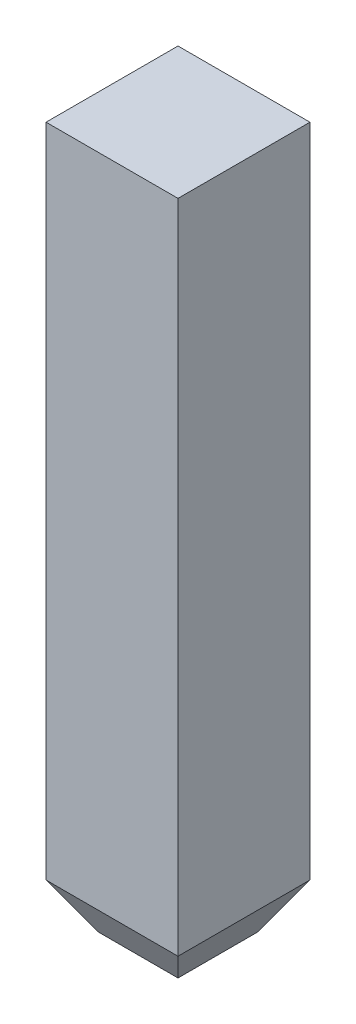
ISO-10303-21;
HEADER;
FILE_DESCRIPTION(('STEP AP214'),'2;1');
FILE_NAME('part.step','',(''),(''),'','','');
FILE_SCHEMA(('AUTOMOTIVE_DESIGN { 1 0 10303 214 1 1 1 1 }'));
ENDSEC;
DATA;
#1=APPLICATION_CONTEXT('core data for automotive mechanical design processes');
#2=APPLICATION_PROTOCOL_DEFINITION('international standard','automotive_design',2000,#1);
#3=PRODUCT_CONTEXT('',#1,'mechanical');
#4=PRODUCT('Part','Part','',(#3));
#5=PRODUCT_RELATED_PRODUCT_CATEGORY('part','',(#4));
#6=PRODUCT_DEFINITION_FORMATION('','',#4);
#7=PRODUCT_DEFINITION_CONTEXT('part definition',#1,'design');
#8=PRODUCT_DEFINITION('design','',#6,#7);
#9=PRODUCT_DEFINITION_SHAPE('','',#8);
#10=(LENGTH_UNIT() NAMED_UNIT(*) SI_UNIT(.MILLI.,.METRE.));
#11=(NAMED_UNIT(*) PLANE_ANGLE_UNIT() SI_UNIT($,.RADIAN.));
#12=(NAMED_UNIT(*) SI_UNIT($,.STERADIAN.) SOLID_ANGLE_UNIT());
#13=UNCERTAINTY_MEASURE_WITH_UNIT(LENGTH_MEASURE(1.E-05),#10,'distance_accuracy_value','');
#14=(GEOMETRIC_REPRESENTATION_CONTEXT(3) GLOBAL_UNCERTAINTY_ASSIGNED_CONTEXT((#13)) GLOBAL_UNIT_ASSIGNED_CONTEXT((#10,
#11,#12)) REPRESENTATION_CONTEXT('',''));
#15=CARTESIAN_POINT('',(0.,0.,0.));
#16=DIRECTION('',(0.,0.,1.));
#17=DIRECTION('',(1.,0.,0.));
#18=AXIS2_PLACEMENT_3D('',#15,#16,#17);
#19=CARTESIAN_POINT('',(1.57,-3.4,0.82));
#20=DIRECTION('',(-1.,0.,0.));
#21=DIRECTION('',(0.,0.,1.));
#22=AXIS2_PLACEMENT_3D('',#19,#20,#21);
#23=PLANE('',#22);
#24=DIRECTION('',(0.,1.,0.));
#25=VECTOR('',#24,1.);
#26=CARTESIAN_POINT('',(1.57,-3.4,0.82));
#27=LINE('',#26,#25);
#28=CARTESIAN_POINT('',(1.57,-3.18349364905389,0.82));
#29=VERTEX_POINT('',#28);
#30=CARTESIAN_POINT('',(1.57,0.,0.82));
#31=VERTEX_POINT('',#30);
#32=EDGE_CURVE('E11',#29,#31,#27,.T.);
#33=ORIENTED_EDGE('',*,*,#32,.F.);
#34=DIRECTION('',(0.,0.,-1.));
#35=VECTOR('',#34,1.);
#36=CARTESIAN_POINT('',(1.57,-3.18349364905389,0.82));
#37=LINE('',#36,#35);
#38=CARTESIAN_POINT('',(1.57,-3.18349364905389,0.18));
#39=VERTEX_POINT('',#38);
#40=EDGE_CURVE('E23',#29,#39,#37,.T.);
#41=ORIENTED_EDGE('',*,*,#40,.T.);
#42=DIRECTION('',(0.,1.,0.));
#43=VECTOR('',#42,1.);
#44=CARTESIAN_POINT('',(1.57,-3.4,0.18));
#45=LINE('',#44,#43);
#46=CARTESIAN_POINT('',(1.57,0.,0.18));
#47=VERTEX_POINT('',#46);
#48=EDGE_CURVE('E116',#39,#47,#45,.T.);
#49=ORIENTED_EDGE('',*,*,#48,.T.);
#50=DIRECTION('',(0.,0.,1.));
#51=VECTOR('',#50,1.);
#52=CARTESIAN_POINT('',(1.57,0.,0.82));
#53=LINE('',#52,#51);
#54=EDGE_CURVE('E114',#47,#31,#53,.T.);
#55=ORIENTED_EDGE('',*,*,#54,.T.);
#56=EDGE_LOOP('',(#33,#41,#49,#55));
#57=FACE_BOUND('',#56,.T.);
#58=ADVANCED_FACE('F16',(#57),#23,.F.);
#59=CARTESIAN_POINT('',(0.93,-3.4,0.82));
#60=DIRECTION('',(0.,0.,-1.));
#61=DIRECTION('',(-1.,0.,0.));
#62=AXIS2_PLACEMENT_3D('',#59,#60,#61);
#63=PLANE('',#62);
#64=DIRECTION('',(0.,1.,0.));
#65=VECTOR('',#64,1.);
#66=CARTESIAN_POINT('',(0.93,-3.4,0.82));
#67=LINE('',#66,#65);
#68=CARTESIAN_POINT('',(0.93,-3.18349364905389,0.82));
#69=VERTEX_POINT('',#68);
#70=CARTESIAN_POINT('',(0.93,0.,0.82));
#71=VERTEX_POINT('',#70);
#72=EDGE_CURVE('E112',#69,#71,#67,.T.);
#73=ORIENTED_EDGE('',*,*,#72,.F.);
#74=DIRECTION('',(1.,0.,0.));
#75=VECTOR('',#74,1.);
#76=CARTESIAN_POINT('',(0.93,-3.18349364905389,0.82));
#77=LINE('',#76,#75);
#78=EDGE_CURVE('E110',#69,#29,#77,.T.);
#79=ORIENTED_EDGE('',*,*,#78,.T.);
#80=ORIENTED_EDGE('',*,*,#32,.T.);
#81=DIRECTION('',(-1.,0.,0.));
#82=VECTOR('',#81,1.);
#83=CARTESIAN_POINT('',(0.93,0.,0.82));
#84=LINE('',#83,#82);
#85=EDGE_CURVE('E108',#31,#71,#84,.T.);
#86=ORIENTED_EDGE('',*,*,#85,.T.);
#87=EDGE_LOOP('',(#73,#79,#80,#86));
#88=FACE_BOUND('',#87,.T.);
#89=ADVANCED_FACE('F138',(#88),#63,.F.);
#90=CARTESIAN_POINT('',(0.93,-3.4,0.18));
#91=DIRECTION('',(1.,0.,0.));
#92=DIRECTION('',(0.,0.,-1.));
#93=AXIS2_PLACEMENT_3D('',#90,#91,#92);
#94=PLANE('',#93);
#95=DIRECTION('',(0.,1.,0.));
#96=VECTOR('',#95,1.);
#97=CARTESIAN_POINT('',(0.93,-3.4,0.18));
#98=LINE('',#97,#96);
#99=CARTESIAN_POINT('',(0.93,-3.18349364905389,0.18));
#100=VERTEX_POINT('',#99);
#101=CARTESIAN_POINT('',(0.93,0.,0.18));
#102=VERTEX_POINT('',#101);
#103=EDGE_CURVE('E106',#100,#102,#98,.T.);
#104=ORIENTED_EDGE('',*,*,#103,.F.);
#105=DIRECTION('',(0.,0.,1.));
#106=VECTOR('',#105,1.);
#107=CARTESIAN_POINT('',(0.93,-3.18349364905389,0.18));
#108=LINE('',#107,#106);
#109=EDGE_CURVE('E103',#100,#69,#108,.T.);
#110=ORIENTED_EDGE('',*,*,#109,.T.);
#111=ORIENTED_EDGE('',*,*,#72,.T.);
#112=DIRECTION('',(0.,0.,-1.));
#113=VECTOR('',#112,1.);
#114=CARTESIAN_POINT('',(0.93,0.,0.18));
#115=LINE('',#114,#113);
#116=EDGE_CURVE('E100',#71,#102,#115,.T.);
#117=ORIENTED_EDGE('',*,*,#116,.T.);
#118=EDGE_LOOP('',(#104,#110,#111,#117));
#119=FACE_BOUND('',#118,.T.);
#120=ADVANCED_FACE('F133',(#119),#94,.F.);
#121=CARTESIAN_POINT('',(1.57,-3.4,0.18));
#122=DIRECTION('',(0.,0.,1.));
#123=DIRECTION('',(1.,0.,0.));
#124=AXIS2_PLACEMENT_3D('',#121,#122,#123);
#125=PLANE('',#124);
#126=ORIENTED_EDGE('',*,*,#48,.F.);
#127=DIRECTION('',(-1.,0.,0.));
#128=VECTOR('',#127,1.);
#129=CARTESIAN_POINT('',(1.57,-3.18349364905389,0.18));
#130=LINE('',#129,#128);
#131=EDGE_CURVE('E97',#39,#100,#130,.T.);
#132=ORIENTED_EDGE('',*,*,#131,.T.);
#133=ORIENTED_EDGE('',*,*,#103,.T.);
#134=DIRECTION('',(1.,0.,0.));
#135=VECTOR('',#134,1.);
#136=CARTESIAN_POINT('',(1.57,0.,0.18));
#137=LINE('',#136,#135);
#138=EDGE_CURVE('E94',#102,#47,#137,.T.);
#139=ORIENTED_EDGE('',*,*,#138,.T.);
#140=EDGE_LOOP('',(#126,#132,#133,#139));
#141=FACE_BOUND('',#140,.T.);
#142=ADVANCED_FACE('F121',(#141),#125,.F.);
#143=CARTESIAN_POINT('',(0.,-3.4,0.));
#144=DIRECTION('',(0.,1.,0.));
#145=DIRECTION('',(0.,0.,1.));
#146=AXIS2_PLACEMENT_3D('',#143,#144,#145);
#147=PLANE('',#146);
#148=DIRECTION('',(0.,0.,-1.));
#149=VECTOR('',#148,1.);
#150=CARTESIAN_POINT('',(1.055,-3.4,0.));
#151=LINE('',#150,#149);
#152=CARTESIAN_POINT('',(1.055,-3.4,0.695));
#153=VERTEX_POINT('',#152);
#154=CARTESIAN_POINT('',(1.055,-3.4,0.305));
#155=VERTEX_POINT('',#154);
#156=EDGE_CURVE('E92',#153,#155,#151,.T.);
#157=ORIENTED_EDGE('',*,*,#156,.T.);
#158=DIRECTION('',(1.,0.,0.));
#159=VECTOR('',#158,1.);
#160=CARTESIAN_POINT('',(0.,-3.4,0.305));
#161=LINE('',#160,#159);
#162=CARTESIAN_POINT('',(1.445,-3.4,0.305));
#163=VERTEX_POINT('',#162);
#164=EDGE_CURVE('E71',#155,#163,#161,.T.);
#165=ORIENTED_EDGE('',*,*,#164,.T.);
#166=DIRECTION('',(0.,0.,1.));
#167=VECTOR('',#166,1.);
#168=CARTESIAN_POINT('',(1.445,-3.4,0.));
#169=LINE('',#168,#167);
#170=CARTESIAN_POINT('',(1.445,-3.4,0.695));
#171=VERTEX_POINT('',#170);
#172=EDGE_CURVE('E65',#163,#171,#169,.T.);
#173=ORIENTED_EDGE('',*,*,#172,.T.);
#174=DIRECTION('',(-1.,0.,0.));
#175=VECTOR('',#174,1.);
#176=CARTESIAN_POINT('',(0.,-3.4,0.695));
#177=LINE('',#176,#175);
#178=EDGE_CURVE('E68',#171,#153,#177,.T.);
#179=ORIENTED_EDGE('',*,*,#178,.T.);
#180=EDGE_LOOP('',(#157,#165,#173,#179));
#181=FACE_BOUND('',#180,.T.);
#182=ADVANCED_FACE('F67',(#181),#147,.F.);
#183=CARTESIAN_POINT('',(0.,0.,0.));
#184=DIRECTION('',(0.,1.,0.));
#185=DIRECTION('',(0.,0.,1.));
#186=AXIS2_PLACEMENT_3D('',#183,#184,#185);
#187=PLANE('',#186);
#188=ORIENTED_EDGE('',*,*,#54,.F.);
#189=ORIENTED_EDGE('',*,*,#138,.F.);
#190=ORIENTED_EDGE('',*,*,#116,.F.);
#191=ORIENTED_EDGE('',*,*,#85,.F.);
#192=EDGE_LOOP('',(#188,#189,#190,#191));
#193=FACE_BOUND('',#192,.T.);
#194=ADVANCED_FACE('F137',(#193),#187,.T.);
#195=CARTESIAN_POINT('',(0.,-3.4,0.695));
#196=DIRECTION('',(0.,0.500000000000001,-0.866025403784438));
#197=DIRECTION('',(-1.,0.,0.));
#198=AXIS2_PLACEMENT_3D('',#195,#196,#197);
#199=PLANE('',#198);
#200=DIRECTION('',(-0.447213595499959,-0.774596669241482,-0.447213595499959));
#201=VECTOR('',#200,1.);
#202=CARTESIAN_POINT('',(1.306,-3.64075506225208,0.555999999999999));
#203=LINE('',#202,#201);
#204=EDGE_CURVE('E81',#29,#171,#203,.T.);
#205=ORIENTED_EDGE('',*,*,#204,.F.);
#206=ORIENTED_EDGE('',*,*,#78,.F.);
#207=DIRECTION('',(-0.447213595499959,0.774596669241483,0.447213595499959));
#208=VECTOR('',#207,1.);
#209=CARTESIAN_POINT('',(0.843999999999999,-3.03453727960297,0.906));
#210=LINE('',#209,#208);
#211=EDGE_CURVE('E83',#153,#69,#210,.T.);
#212=ORIENTED_EDGE('',*,*,#211,.F.);
#213=ORIENTED_EDGE('',*,*,#178,.F.);
#214=EDGE_LOOP('',(#205,#206,#212,#213));
#215=FACE_BOUND('',#214,.T.);
#216=ADVANCED_FACE('F79',(#215),#199,.F.);
#217=CARTESIAN_POINT('',(1.055,-3.4,0.));
#218=DIRECTION('',(0.866025403784438,0.500000000000001,0.));
#219=DIRECTION('',(0.,0.,-1.));
#220=AXIS2_PLACEMENT_3D('',#217,#218,#219);
#221=PLANE('',#220);
#222=ORIENTED_EDGE('',*,*,#211,.T.);
#223=ORIENTED_EDGE('',*,*,#109,.F.);
#224=DIRECTION('',(-0.447213595499959,0.774596669241483,-0.447213595499959));
#225=VECTOR('',#224,1.);
#226=CARTESIAN_POINT('',(0.994,-3.2943449007383,0.244));
#227=LINE('',#226,#225);
#228=EDGE_CURVE('E87',#155,#100,#227,.T.);
#229=ORIENTED_EDGE('',*,*,#228,.F.);
#230=ORIENTED_EDGE('',*,*,#156,.F.);
#231=EDGE_LOOP('',(#222,#223,#229,#230));
#232=FACE_BOUND('',#231,.T.);
#233=ADVANCED_FACE('F131',(#232),#221,.F.);
#234=CARTESIAN_POINT('',(1.445,-3.4,0.));
#235=DIRECTION('',(-0.866025403784438,0.500000000000001,0.));
#236=DIRECTION('',(0.,0.,1.));
#237=AXIS2_PLACEMENT_3D('',#234,#235,#236);
#238=PLANE('',#237);
#239=ORIENTED_EDGE('',*,*,#204,.T.);
#240=ORIENTED_EDGE('',*,*,#172,.F.);
#241=DIRECTION('',(-0.447213595499959,-0.774596669241483,0.447213595499959));
#242=VECTOR('',#241,1.);
#243=CARTESIAN_POINT('',(1.506,-3.2943449007383,0.244));
#244=LINE('',#243,#242);
#245=EDGE_CURVE('E126',#39,#163,#244,.T.);
#246=ORIENTED_EDGE('',*,*,#245,.F.);
#247=ORIENTED_EDGE('',*,*,#40,.F.);
#248=EDGE_LOOP('',(#239,#240,#246,#247));
#249=FACE_BOUND('',#248,.T.);
#250=ADVANCED_FACE('F85',(#249),#238,.F.);
#251=CARTESIAN_POINT('',(0.,-3.4,0.305));
#252=DIRECTION('',(0.,0.500000000000001,0.866025403784438));
#253=DIRECTION('',(1.,0.,0.));
#254=AXIS2_PLACEMENT_3D('',#251,#252,#253);
#255=PLANE('',#254);
#256=ORIENTED_EDGE('',*,*,#228,.T.);
#257=ORIENTED_EDGE('',*,*,#131,.F.);
#258=ORIENTED_EDGE('',*,*,#245,.T.);
#259=ORIENTED_EDGE('',*,*,#164,.F.);
#260=EDGE_LOOP('',(#256,#257,#258,#259));
#261=FACE_BOUND('',#260,.T.);
#262=ADVANCED_FACE('F125',(#261),#255,.F.);
#263=CLOSED_SHELL('',(#58,#89,#120,#142,#182,#194,#216,#233,#250,#262));
#264=MANIFOLD_SOLID_BREP('B1',#263);
#265=ADVANCED_BREP_SHAPE_REPRESENTATION('',(#18,#264),#14);
#266=SHAPE_DEFINITION_REPRESENTATION(#9,#265);
ENDSEC;
END-ISO-10303-21;
